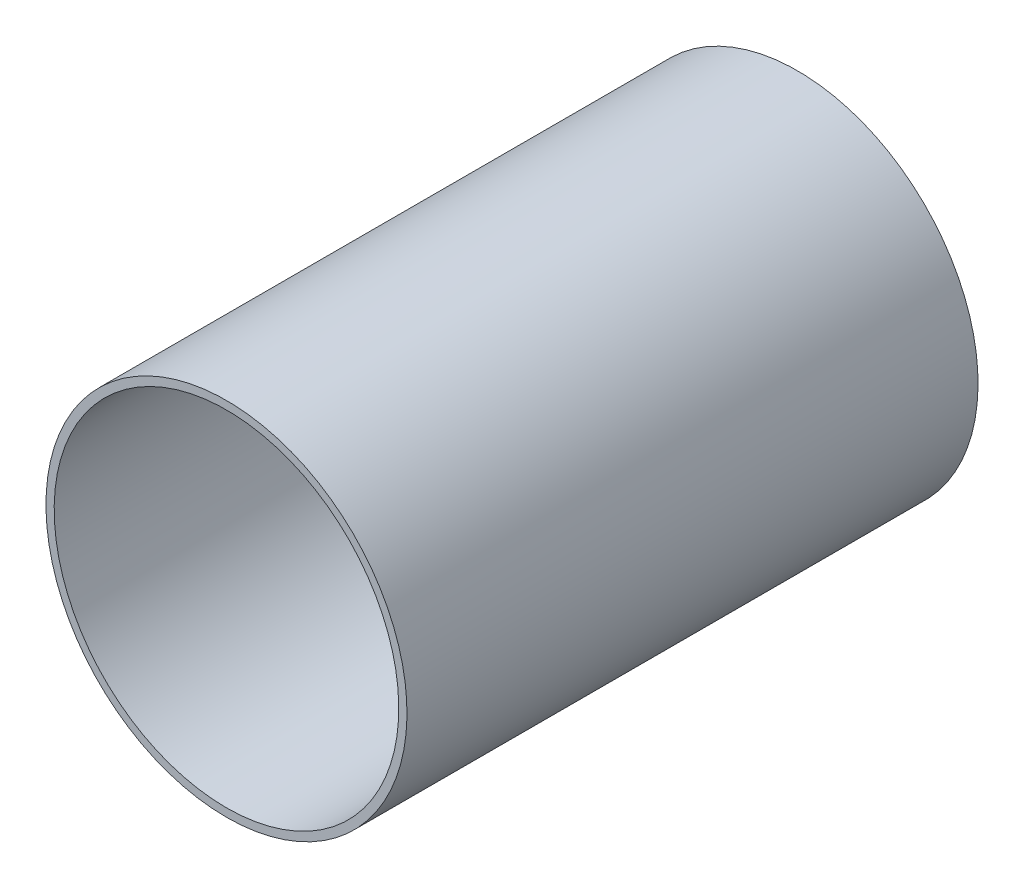
ISO-10303-21;
HEADER;
FILE_DESCRIPTION(('STEP AP214'),'2;1');
FILE_NAME('part.step','',(''),(''),'','','');
FILE_SCHEMA(('AUTOMOTIVE_DESIGN { 1 0 10303 214 1 1 1 1 }'));
ENDSEC;
DATA;
#1=APPLICATION_CONTEXT('core data for automotive mechanical design processes');
#2=APPLICATION_PROTOCOL_DEFINITION('international standard','automotive_design',2000,#1);
#3=PRODUCT_CONTEXT('',#1,'mechanical');
#4=PRODUCT('Part','Part','',(#3));
#5=PRODUCT_RELATED_PRODUCT_CATEGORY('part','',(#4));
#6=PRODUCT_DEFINITION_FORMATION('','',#4);
#7=PRODUCT_DEFINITION_CONTEXT('part definition',#1,'design');
#8=PRODUCT_DEFINITION('design','',#6,#7);
#9=PRODUCT_DEFINITION_SHAPE('','',#8);
#10=(LENGTH_UNIT() NAMED_UNIT(*) SI_UNIT(.MILLI.,.METRE.));
#11=(NAMED_UNIT(*) PLANE_ANGLE_UNIT() SI_UNIT($,.RADIAN.));
#12=(NAMED_UNIT(*) SI_UNIT($,.STERADIAN.) SOLID_ANGLE_UNIT());
#13=UNCERTAINTY_MEASURE_WITH_UNIT(LENGTH_MEASURE(1.E-05),#10,'distance_accuracy_value','');
#14=(GEOMETRIC_REPRESENTATION_CONTEXT(3) GLOBAL_UNCERTAINTY_ASSIGNED_CONTEXT((#13)) GLOBAL_UNIT_ASSIGNED_CONTEXT((#10,
#11,#12)) REPRESENTATION_CONTEXT('',''));
#15=CARTESIAN_POINT('',(0.,0.,0.));
#16=DIRECTION('',(0.,0.,1.));
#17=DIRECTION('',(1.,0.,0.));
#18=AXIS2_PLACEMENT_3D('',#15,#16,#17);
#19=CARTESIAN_POINT('',(136.902,-111.734,-0.045));
#20=DIRECTION('',(0.,0.,-1.));
#21=DIRECTION('',(0.,-1.,0.));
#22=AXIS2_PLACEMENT_3D('',#19,#20,#21);
#23=CYLINDRICAL_SURFACE('',#22,0.525);
#24=CARTESIAN_POINT('',(136.902,-111.734,-0.035));
#25=DIRECTION('',(0.,0.,-1.));
#26=DIRECTION('',(0.,-1.,0.));
#27=AXIS2_PLACEMENT_3D('',#24,#25,#26);
#28=CIRCLE('',#27,0.525);
#29=CARTESIAN_POINT('',(136.902,-112.259,-0.035));
#30=VERTEX_POINT('',#29);
#31=EDGE_CURVE('E64',#30,#30,#28,.T.);
#32=ORIENTED_EDGE('',*,*,#31,.T.);
#33=DIRECTION('',(0.,0.,1.));
#34=VECTOR('',#33,1.);
#35=CARTESIAN_POINT('',(136.902,-112.259,-0.045));
#36=LINE('',#35,#34);
#37=CARTESIAN_POINT('',(136.902,-112.259,1.705));
#38=VERTEX_POINT('',#37);
#39=EDGE_CURVE('E11',#30,#38,#36,.T.);
#40=ORIENTED_EDGE('',*,*,#39,.T.);
#41=CARTESIAN_POINT('',(136.902,-111.734,1.705));
#42=DIRECTION('',(0.,0.,-1.));
#43=DIRECTION('',(0.,-1.,0.));
#44=AXIS2_PLACEMENT_3D('',#41,#42,#43);
#45=CIRCLE('',#44,0.525);
#46=EDGE_CURVE('E25',#38,#38,#45,.T.);
#47=ORIENTED_EDGE('',*,*,#46,.F.);
#48=ORIENTED_EDGE('',*,*,#39,.F.);
#49=EDGE_LOOP('',(#32,#40,#47,#48));
#50=FACE_BOUND('',#49,.T.);
#51=ADVANCED_FACE('F17',(#50),#23,.F.);
#52=CARTESIAN_POINT('',(136.902,-112.284,1.705));
#53=DIRECTION('',(0.,0.,1.));
#54=DIRECTION('',(1.,0.,0.));
#55=AXIS2_PLACEMENT_3D('',#52,#53,#54);
#56=PLANE('',#55);
#57=ORIENTED_EDGE('',*,*,#46,.T.);
#58=EDGE_LOOP('',(#57));
#59=FACE_BOUND('',#58,.T.);
#60=CARTESIAN_POINT('',(136.902,-111.734,1.705));
#61=DIRECTION('',(0.,0.,1.));
#62=DIRECTION('',(0.,-1.,0.));
#63=AXIS2_PLACEMENT_3D('',#60,#61,#62);
#64=CIRCLE('',#63,0.55);
#65=CARTESIAN_POINT('',(136.902,-112.284,1.705));
#66=VERTEX_POINT('',#65);
#67=EDGE_CURVE('E56',#66,#66,#64,.T.);
#68=ORIENTED_EDGE('',*,*,#67,.T.);
#69=EDGE_LOOP('',(#68));
#70=FACE_BOUND('',#69,.T.);
#71=ADVANCED_FACE('F73',(#59,#70),#56,.T.);
#72=CARTESIAN_POINT('',(136.902,-112.284,-0.035));
#73=DIRECTION('',(0.,0.,1.));
#74=DIRECTION('',(1.,0.,0.));
#75=AXIS2_PLACEMENT_3D('',#72,#73,#74);
#76=PLANE('',#75);
#77=ORIENTED_EDGE('',*,*,#31,.F.);
#78=EDGE_LOOP('',(#77));
#79=FACE_BOUND('',#78,.T.);
#80=CARTESIAN_POINT('',(136.902,-111.734,-0.035));
#81=DIRECTION('',(0.,0.,1.));
#82=DIRECTION('',(0.,-1.,0.));
#83=AXIS2_PLACEMENT_3D('',#80,#81,#82);
#84=CIRCLE('',#83,0.55);
#85=CARTESIAN_POINT('',(136.902,-112.284,-0.035));
#86=VERTEX_POINT('',#85);
#87=EDGE_CURVE('E55',#86,#86,#84,.T.);
#88=ORIENTED_EDGE('',*,*,#87,.F.);
#89=EDGE_LOOP('',(#88));
#90=FACE_BOUND('',#89,.T.);
#91=ADVANCED_FACE('F82',(#79,#90),#76,.F.);
#92=CARTESIAN_POINT('',(136.902,-111.734,-0.035));
#93=DIRECTION('',(0.,0.,-1.));
#94=DIRECTION('',(0.,-1.,0.));
#95=AXIS2_PLACEMENT_3D('',#92,#93,#94);
#96=CYLINDRICAL_SURFACE('',#95,0.55);
#97=ORIENTED_EDGE('',*,*,#87,.T.);
#98=DIRECTION('',(0.,0.,1.));
#99=VECTOR('',#98,1.);
#100=CARTESIAN_POINT('',(136.902,-112.284,-0.035));
#101=LINE('',#100,#99);
#102=EDGE_CURVE('E52',#86,#66,#101,.T.);
#103=ORIENTED_EDGE('',*,*,#102,.T.);
#104=ORIENTED_EDGE('',*,*,#67,.F.);
#105=ORIENTED_EDGE('',*,*,#102,.F.);
#106=EDGE_LOOP('',(#97,#103,#104,#105));
#107=FACE_BOUND('',#106,.T.);
#108=ADVANCED_FACE('F53',(#107),#96,.T.);
#109=CLOSED_SHELL('',(#51,#71,#91,#108));
#110=MANIFOLD_SOLID_BREP('B1',#109);
#111=ADVANCED_BREP_SHAPE_REPRESENTATION('',(#18,#110),#14);
#112=SHAPE_DEFINITION_REPRESENTATION(#9,#111);
ENDSEC;
END-ISO-10303-21;
